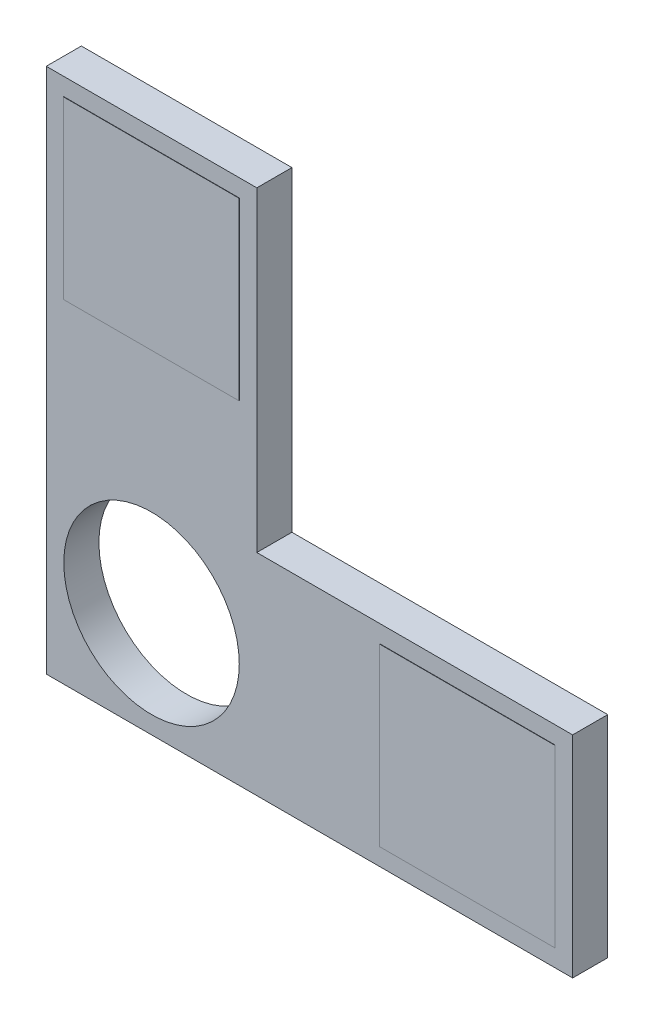
ISO-10303-21;
HEADER;
FILE_DESCRIPTION(('STEP AP214'),'2;1');
FILE_NAME('part.step','',(''),(''),'','','');
FILE_SCHEMA(('AUTOMOTIVE_DESIGN { 1 0 10303 214 1 1 1 1 }'));
ENDSEC;
DATA;
#1=APPLICATION_CONTEXT('core data for automotive mechanical design processes');
#2=APPLICATION_PROTOCOL_DEFINITION('international standard','automotive_design',2000,#1);
#3=PRODUCT_CONTEXT('',#1,'mechanical');
#4=PRODUCT('Part','Part','',(#3));
#5=PRODUCT_RELATED_PRODUCT_CATEGORY('part','',(#4));
#6=PRODUCT_DEFINITION_FORMATION('','',#4);
#7=PRODUCT_DEFINITION_CONTEXT('part definition',#1,'design');
#8=PRODUCT_DEFINITION('design','',#6,#7);
#9=PRODUCT_DEFINITION_SHAPE('','',#8);
#10=(LENGTH_UNIT() NAMED_UNIT(*) SI_UNIT(.MILLI.,.METRE.));
#11=(NAMED_UNIT(*) PLANE_ANGLE_UNIT() SI_UNIT($,.RADIAN.));
#12=(NAMED_UNIT(*) SI_UNIT($,.STERADIAN.) SOLID_ANGLE_UNIT());
#13=UNCERTAINTY_MEASURE_WITH_UNIT(LENGTH_MEASURE(1.E-05),#10,'distance_accuracy_value','');
#14=(GEOMETRIC_REPRESENTATION_CONTEXT(3) GLOBAL_UNCERTAINTY_ASSIGNED_CONTEXT((#13)) GLOBAL_UNIT_ASSIGNED_CONTEXT((#10,
#11,#12)) REPRESENTATION_CONTEXT('',''));
#15=CARTESIAN_POINT('',(0.,0.,0.));
#16=DIRECTION('',(0.,0.,1.));
#17=DIRECTION('',(1.,0.,0.));
#18=AXIS2_PLACEMENT_3D('',#15,#16,#17);
#19=CARTESIAN_POINT('',(0.,0.,10.));
#20=DIRECTION('',(0.,0.,-1.));
#21=DIRECTION('',(-1.,0.,0.));
#22=AXIS2_PLACEMENT_3D('',#19,#20,#21);
#23=PLANE('',#22);
#24=DIRECTION('',(0.,-1.,0.));
#25=VECTOR('',#24,1.);
#26=CARTESIAN_POINT('',(5.,145.,10.));
#27=LINE('',#26,#25);
#28=CARTESIAN_POINT('',(5.,145.,10.));
#29=VERTEX_POINT('',#28);
#30=CARTESIAN_POINT('',(5.00000000000001,95.,10.));
#31=VERTEX_POINT('',#30);
#32=EDGE_CURVE('E155',#29,#31,#27,.T.);
#33=ORIENTED_EDGE('',*,*,#32,.F.);
#34=DIRECTION('',(-1.,0.,0.));
#35=VECTOR('',#34,1.);
#36=CARTESIAN_POINT('',(5.,145.,10.));
#37=LINE('',#36,#35);
#38=CARTESIAN_POINT('',(55.,145.,10.));
#39=VERTEX_POINT('',#38);
#40=EDGE_CURVE('E168',#39,#29,#37,.T.);
#41=ORIENTED_EDGE('',*,*,#40,.F.);
#42=DIRECTION('',(0.,1.,0.));
#43=VECTOR('',#42,1.);
#44=CARTESIAN_POINT('',(55.,145.,10.));
#45=LINE('',#44,#43);
#46=CARTESIAN_POINT('',(55.,95.,10.));
#47=VERTEX_POINT('',#46);
#48=EDGE_CURVE('E177',#47,#39,#45,.T.);
#49=ORIENTED_EDGE('',*,*,#48,.F.);
#50=DIRECTION('',(1.,0.,0.));
#51=VECTOR('',#50,1.);
#52=CARTESIAN_POINT('',(5.00000000000001,95.,10.));
#53=LINE('',#52,#51);
#54=EDGE_CURVE('E158',#31,#47,#53,.T.);
#55=ORIENTED_EDGE('',*,*,#54,.F.);
#56=EDGE_LOOP('',(#33,#41,#49,#55));
#57=FACE_BOUND('',#56,.T.);
#58=DIRECTION('',(-1.,0.,0.));
#59=VECTOR('',#58,1.);
#60=CARTESIAN_POINT('',(0.,150.,10.));
#61=LINE('',#60,#59);
#62=CARTESIAN_POINT('',(60.,150.,10.));
#63=VERTEX_POINT('',#62);
#64=CARTESIAN_POINT('',(0.,150.,10.));
#65=VERTEX_POINT('',#64);
#66=EDGE_CURVE('E200',#63,#65,#61,.T.);
#67=ORIENTED_EDGE('',*,*,#66,.T.);
#68=DIRECTION('',(0.,-1.,0.));
#69=VECTOR('',#68,1.);
#70=CARTESIAN_POINT('',(0.,0.,10.));
#71=LINE('',#70,#69);
#72=CARTESIAN_POINT('',(0.,0.,10.));
#73=VERTEX_POINT('',#72);
#74=EDGE_CURVE('E203',#65,#73,#71,.T.);
#75=ORIENTED_EDGE('',*,*,#74,.T.);
#76=DIRECTION('',(1.,0.,0.));
#77=VECTOR('',#76,1.);
#78=CARTESIAN_POINT('',(150.,0.,10.));
#79=LINE('',#78,#77);
#80=CARTESIAN_POINT('',(150.,0.,10.));
#81=VERTEX_POINT('',#80);
#82=EDGE_CURVE('E206',#73,#81,#79,.T.);
#83=ORIENTED_EDGE('',*,*,#82,.T.);
#84=DIRECTION('',(0.,1.,0.));
#85=VECTOR('',#84,1.);
#86=CARTESIAN_POINT('',(150.,60.,10.));
#87=LINE('',#86,#85);
#88=CARTESIAN_POINT('',(150.,60.,10.));
#89=VERTEX_POINT('',#88);
#90=EDGE_CURVE('E208',#81,#89,#87,.T.);
#91=ORIENTED_EDGE('',*,*,#90,.T.);
#92=DIRECTION('',(-1.,0.,0.));
#93=VECTOR('',#92,1.);
#94=CARTESIAN_POINT('',(60.,60.,10.));
#95=LINE('',#94,#93);
#96=CARTESIAN_POINT('',(60.,60.,10.));
#97=VERTEX_POINT('',#96);
#98=EDGE_CURVE('E210',#89,#97,#95,.T.);
#99=ORIENTED_EDGE('',*,*,#98,.T.);
#100=DIRECTION('',(0.,1.,0.));
#101=VECTOR('',#100,1.);
#102=CARTESIAN_POINT('',(60.,150.,10.));
#103=LINE('',#102,#101);
#104=EDGE_CURVE('E212',#97,#63,#103,.T.);
#105=ORIENTED_EDGE('',*,*,#104,.T.);
#106=EDGE_LOOP('',(#67,#75,#83,#91,#99,#105));
#107=FACE_BOUND('',#106,.T.);
#108=CARTESIAN_POINT('',(30.,30.,10.));
#109=DIRECTION('',(0.,0.,1.));
#110=DIRECTION('',(1.,0.,0.));
#111=AXIS2_PLACEMENT_3D('',#108,#109,#110);
#112=CIRCLE('',#111,25.);
#113=CARTESIAN_POINT('',(55.,30.,10.));
#114=VERTEX_POINT('',#113);
#115=EDGE_CURVE('E194',#114,#114,#112,.T.);
#116=ORIENTED_EDGE('',*,*,#115,.F.);
#117=EDGE_LOOP('',(#116));
#118=FACE_BOUND('',#117,.T.);
#119=DIRECTION('',(0.,1.,0.));
#120=VECTOR('',#119,1.);
#121=CARTESIAN_POINT('',(145.,4.99999999999998,10.));
#122=LINE('',#121,#120);
#123=CARTESIAN_POINT('',(145.,4.99999999999998,10.));
#124=VERTEX_POINT('',#123);
#125=CARTESIAN_POINT('',(145.,54.9999999999999,10.));
#126=VERTEX_POINT('',#125);
#127=EDGE_CURVE('E154',#124,#126,#122,.T.);
#128=ORIENTED_EDGE('',*,*,#127,.F.);
#129=DIRECTION('',(1.,0.,0.));
#130=VECTOR('',#129,1.);
#131=CARTESIAN_POINT('',(145.,4.99999999999998,10.));
#132=LINE('',#131,#130);
#133=CARTESIAN_POINT('',(94.9999999999999,4.99999999999998,10.));
#134=VERTEX_POINT('',#133);
#135=EDGE_CURVE('E151',#134,#124,#132,.T.);
#136=ORIENTED_EDGE('',*,*,#135,.F.);
#137=DIRECTION('',(0.,-1.,0.));
#138=VECTOR('',#137,1.);
#139=CARTESIAN_POINT('',(94.9999999999999,4.99999999999998,10.));
#140=LINE('',#139,#138);
#141=CARTESIAN_POINT('',(94.9999999999999,55.,10.));
#142=VERTEX_POINT('',#141);
#143=EDGE_CURVE('E53',#142,#134,#140,.T.);
#144=ORIENTED_EDGE('',*,*,#143,.F.);
#145=DIRECTION('',(-1.,0.,0.));
#146=VECTOR('',#145,1.);
#147=CARTESIAN_POINT('',(145.,54.9999999999999,10.));
#148=LINE('',#147,#146);
#149=EDGE_CURVE('E48',#126,#142,#148,.T.);
#150=ORIENTED_EDGE('',*,*,#149,.F.);
#151=EDGE_LOOP('',(#128,#136,#144,#150));
#152=FACE_BOUND('',#151,.T.);
#153=ADVANCED_FACE('F33',(#57,#107,#118,#152),#23,.F.);
#154=CARTESIAN_POINT('',(0.,0.,0.));
#155=DIRECTION('',(0.,0.,-1.));
#156=DIRECTION('',(-1.,0.,0.));
#157=AXIS2_PLACEMENT_3D('',#154,#155,#156);
#158=PLANE('',#157);
#159=DIRECTION('',(-1.,0.,0.));
#160=VECTOR('',#159,1.);
#161=CARTESIAN_POINT('',(0.,150.,0.));
#162=LINE('',#161,#160);
#163=CARTESIAN_POINT('',(60.,150.,0.));
#164=VERTEX_POINT('',#163);
#165=CARTESIAN_POINT('',(0.,150.,0.));
#166=VERTEX_POINT('',#165);
#167=EDGE_CURVE('E197',#164,#166,#162,.T.);
#168=ORIENTED_EDGE('',*,*,#167,.F.);
#169=DIRECTION('',(0.,1.,0.));
#170=VECTOR('',#169,1.);
#171=CARTESIAN_POINT('',(60.,150.,0.));
#172=LINE('',#171,#170);
#173=CARTESIAN_POINT('',(60.,60.,0.));
#174=VERTEX_POINT('',#173);
#175=EDGE_CURVE('E204',#174,#164,#172,.T.);
#176=ORIENTED_EDGE('',*,*,#175,.F.);
#177=DIRECTION('',(-1.,0.,0.));
#178=VECTOR('',#177,1.);
#179=CARTESIAN_POINT('',(60.,60.,0.));
#180=LINE('',#179,#178);
#181=CARTESIAN_POINT('',(150.,60.,0.));
#182=VERTEX_POINT('',#181);
#183=EDGE_CURVE('E223',#182,#174,#180,.T.);
#184=ORIENTED_EDGE('',*,*,#183,.F.);
#185=DIRECTION('',(0.,1.,0.));
#186=VECTOR('',#185,1.);
#187=CARTESIAN_POINT('',(150.,60.,0.));
#188=LINE('',#187,#186);
#189=CARTESIAN_POINT('',(150.,0.,0.));
#190=VERTEX_POINT('',#189);
#191=EDGE_CURVE('E221',#190,#182,#188,.T.);
#192=ORIENTED_EDGE('',*,*,#191,.F.);
#193=DIRECTION('',(1.,0.,0.));
#194=VECTOR('',#193,1.);
#195=CARTESIAN_POINT('',(150.,0.,0.));
#196=LINE('',#195,#194);
#197=CARTESIAN_POINT('',(0.,0.,0.));
#198=VERTEX_POINT('',#197);
#199=EDGE_CURVE('E219',#198,#190,#196,.T.);
#200=ORIENTED_EDGE('',*,*,#199,.F.);
#201=DIRECTION('',(0.,-1.,0.));
#202=VECTOR('',#201,1.);
#203=CARTESIAN_POINT('',(0.,0.,0.));
#204=LINE('',#203,#202);
#205=EDGE_CURVE('E217',#166,#198,#204,.T.);
#206=ORIENTED_EDGE('',*,*,#205,.F.);
#207=EDGE_LOOP('',(#168,#176,#184,#192,#200,#206));
#208=FACE_BOUND('',#207,.T.);
#209=CARTESIAN_POINT('',(30.,30.,0.));
#210=DIRECTION('',(0.,0.,1.));
#211=DIRECTION('',(1.,0.,0.));
#212=AXIS2_PLACEMENT_3D('',#209,#210,#211);
#213=CIRCLE('',#212,25.);
#214=CARTESIAN_POINT('',(55.,30.,0.));
#215=VERTEX_POINT('',#214);
#216=EDGE_CURVE('E193',#215,#215,#213,.T.);
#217=ORIENTED_EDGE('',*,*,#216,.T.);
#218=EDGE_LOOP('',(#217));
#219=FACE_BOUND('',#218,.T.);
#220=ADVANCED_FACE('F247',(#208,#219),#158,.T.);
#221=CARTESIAN_POINT('',(0.,150.,10.));
#222=DIRECTION('',(0.,-1.,0.));
#223=DIRECTION('',(0.,0.,-1.));
#224=AXIS2_PLACEMENT_3D('',#221,#222,#223);
#225=PLANE('',#224);
#226=ORIENTED_EDGE('',*,*,#167,.T.);
#227=DIRECTION('',(0.,0.,-1.));
#228=VECTOR('',#227,1.);
#229=CARTESIAN_POINT('',(0.,150.,10.));
#230=LINE('',#229,#228);
#231=EDGE_CURVE('E11',#65,#166,#230,.T.);
#232=ORIENTED_EDGE('',*,*,#231,.F.);
#233=ORIENTED_EDGE('',*,*,#66,.F.);
#234=DIRECTION('',(0.,0.,-1.));
#235=VECTOR('',#234,1.);
#236=CARTESIAN_POINT('',(60.,150.,10.));
#237=LINE('',#236,#235);
#238=EDGE_CURVE('E214',#63,#164,#237,.T.);
#239=ORIENTED_EDGE('',*,*,#238,.T.);
#240=EDGE_LOOP('',(#226,#232,#233,#239));
#241=FACE_BOUND('',#240,.T.);
#242=ADVANCED_FACE('F35',(#241),#225,.F.);
#243=CARTESIAN_POINT('',(0.,0.,10.));
#244=DIRECTION('',(1.,0.,0.));
#245=DIRECTION('',(0.,0.,-1.));
#246=AXIS2_PLACEMENT_3D('',#243,#244,#245);
#247=PLANE('',#246);
#248=ORIENTED_EDGE('',*,*,#205,.T.);
#249=DIRECTION('',(0.,0.,-1.));
#250=VECTOR('',#249,1.);
#251=CARTESIAN_POINT('',(0.,0.,10.));
#252=LINE('',#251,#250);
#253=EDGE_CURVE('E41',#73,#198,#252,.T.);
#254=ORIENTED_EDGE('',*,*,#253,.F.);
#255=ORIENTED_EDGE('',*,*,#74,.F.);
#256=ORIENTED_EDGE('',*,*,#231,.T.);
#257=EDGE_LOOP('',(#248,#254,#255,#256));
#258=FACE_BOUND('',#257,.T.);
#259=ADVANCED_FACE('F265',(#258),#247,.F.);
#260=CARTESIAN_POINT('',(150.,0.,10.));
#261=DIRECTION('',(0.,1.,0.));
#262=DIRECTION('',(-1.,0.,0.));
#263=AXIS2_PLACEMENT_3D('',#260,#261,#262);
#264=PLANE('',#263);
#265=ORIENTED_EDGE('',*,*,#199,.T.);
#266=DIRECTION('',(0.,0.,-1.));
#267=VECTOR('',#266,1.);
#268=CARTESIAN_POINT('',(150.,0.,10.));
#269=LINE('',#268,#267);
#270=EDGE_CURVE('E234',#81,#190,#269,.T.);
#271=ORIENTED_EDGE('',*,*,#270,.F.);
#272=ORIENTED_EDGE('',*,*,#82,.F.);
#273=ORIENTED_EDGE('',*,*,#253,.T.);
#274=EDGE_LOOP('',(#265,#271,#272,#273));
#275=FACE_BOUND('',#274,.T.);
#276=ADVANCED_FACE('F241',(#275),#264,.F.);
#277=CARTESIAN_POINT('',(150.,60.,10.));
#278=DIRECTION('',(-1.,0.,0.));
#279=DIRECTION('',(0.,0.,1.));
#280=AXIS2_PLACEMENT_3D('',#277,#278,#279);
#281=PLANE('',#280);
#282=ORIENTED_EDGE('',*,*,#191,.T.);
#283=DIRECTION('',(0.,0.,-1.));
#284=VECTOR('',#283,1.);
#285=CARTESIAN_POINT('',(150.,60.,10.));
#286=LINE('',#285,#284);
#287=EDGE_CURVE('E231',#89,#182,#286,.T.);
#288=ORIENTED_EDGE('',*,*,#287,.F.);
#289=ORIENTED_EDGE('',*,*,#90,.F.);
#290=ORIENTED_EDGE('',*,*,#270,.T.);
#291=EDGE_LOOP('',(#282,#288,#289,#290));
#292=FACE_BOUND('',#291,.T.);
#293=ADVANCED_FACE('F253',(#292),#281,.F.);
#294=CARTESIAN_POINT('',(60.,60.,10.));
#295=DIRECTION('',(0.,-1.,0.));
#296=DIRECTION('',(0.,0.,-1.));
#297=AXIS2_PLACEMENT_3D('',#294,#295,#296);
#298=PLANE('',#297);
#299=ORIENTED_EDGE('',*,*,#183,.T.);
#300=DIRECTION('',(0.,0.,-1.));
#301=VECTOR('',#300,1.);
#302=CARTESIAN_POINT('',(60.,60.,10.));
#303=LINE('',#302,#301);
#304=EDGE_CURVE('E228',#97,#174,#303,.T.);
#305=ORIENTED_EDGE('',*,*,#304,.F.);
#306=ORIENTED_EDGE('',*,*,#98,.F.);
#307=ORIENTED_EDGE('',*,*,#287,.T.);
#308=EDGE_LOOP('',(#299,#305,#306,#307));
#309=FACE_BOUND('',#308,.T.);
#310=ADVANCED_FACE('F257',(#309),#298,.F.);
#311=CARTESIAN_POINT('',(60.,150.,10.));
#312=DIRECTION('',(-1.,0.,0.));
#313=DIRECTION('',(0.,0.,1.));
#314=AXIS2_PLACEMENT_3D('',#311,#312,#313);
#315=PLANE('',#314);
#316=ORIENTED_EDGE('',*,*,#175,.T.);
#317=ORIENTED_EDGE('',*,*,#238,.F.);
#318=ORIENTED_EDGE('',*,*,#104,.F.);
#319=ORIENTED_EDGE('',*,*,#304,.T.);
#320=EDGE_LOOP('',(#316,#317,#318,#319));
#321=FACE_BOUND('',#320,.T.);
#322=ADVANCED_FACE('F268',(#321),#315,.F.);
#323=CARTESIAN_POINT('',(30.,30.,10.));
#324=DIRECTION('',(0.,0.,-1.));
#325=DIRECTION('',(-1.,0.,0.));
#326=AXIS2_PLACEMENT_3D('',#323,#324,#325);
#327=CYLINDRICAL_SURFACE('',#326,25.);
#328=ORIENTED_EDGE('',*,*,#115,.T.);
#329=EDGE_LOOP('',(#328));
#330=FACE_BOUND('',#329,.T.);
#331=ORIENTED_EDGE('',*,*,#216,.F.);
#332=EDGE_LOOP('',(#331));
#333=FACE_BOUND('',#332,.T.);
#334=ADVANCED_FACE('F270',(#330,#333),#327,.F.);
#335=CARTESIAN_POINT('',(5.,145.,10.1));
#336=DIRECTION('',(1.,0.,0.));
#337=DIRECTION('',(0.,1.,0.));
#338=AXIS2_PLACEMENT_3D('',#335,#336,#337);
#339=PLANE('',#338);
#340=ORIENTED_EDGE('',*,*,#32,.T.);
#341=DIRECTION('',(0.,0.,-1.));
#342=VECTOR('',#341,1.);
#343=CARTESIAN_POINT('',(5.00000000000001,95.,10.1));
#344=LINE('',#343,#342);
#345=CARTESIAN_POINT('',(5.00000000000001,95.,10.1));
#346=VERTEX_POINT('',#345);
#347=EDGE_CURVE('E190',#346,#31,#344,.T.);
#348=ORIENTED_EDGE('',*,*,#347,.F.);
#349=DIRECTION('',(0.,-1.,0.));
#350=VECTOR('',#349,1.);
#351=CARTESIAN_POINT('',(5.,145.,10.1));
#352=LINE('',#351,#350);
#353=CARTESIAN_POINT('',(5.,145.,10.1));
#354=VERTEX_POINT('',#353);
#355=EDGE_CURVE('E164',#354,#346,#352,.T.);
#356=ORIENTED_EDGE('',*,*,#355,.F.);
#357=DIRECTION('',(0.,0.,-1.));
#358=VECTOR('',#357,1.);
#359=CARTESIAN_POINT('',(5.,145.,10.1));
#360=LINE('',#359,#358);
#361=EDGE_CURVE('E173',#354,#29,#360,.T.);
#362=ORIENTED_EDGE('',*,*,#361,.T.);
#363=EDGE_LOOP('',(#340,#348,#356,#362));
#364=FACE_BOUND('',#363,.T.);
#365=ADVANCED_FACE('F276',(#364),#339,.F.);
#366=CARTESIAN_POINT('',(5.00000000000001,95.,10.1));
#367=DIRECTION('',(0.,1.,0.));
#368=DIRECTION('',(0.,0.,1.));
#369=AXIS2_PLACEMENT_3D('',#366,#367,#368);
#370=PLANE('',#369);
#371=ORIENTED_EDGE('',*,*,#54,.T.);
#372=DIRECTION('',(0.,0.,-1.));
#373=VECTOR('',#372,1.);
#374=CARTESIAN_POINT('',(55.,95.,10.1));
#375=LINE('',#374,#373);
#376=CARTESIAN_POINT('',(55.,95.,10.1));
#377=VERTEX_POINT('',#376);
#378=EDGE_CURVE('E187',#377,#47,#375,.T.);
#379=ORIENTED_EDGE('',*,*,#378,.F.);
#380=DIRECTION('',(1.,0.,0.));
#381=VECTOR('',#380,1.);
#382=CARTESIAN_POINT('',(5.00000000000001,95.,10.1));
#383=LINE('',#382,#381);
#384=EDGE_CURVE('E167',#346,#377,#383,.T.);
#385=ORIENTED_EDGE('',*,*,#384,.F.);
#386=ORIENTED_EDGE('',*,*,#347,.T.);
#387=EDGE_LOOP('',(#371,#379,#385,#386));
#388=FACE_BOUND('',#387,.T.);
#389=ADVANCED_FACE('F290',(#388),#370,.F.);
#390=CARTESIAN_POINT('',(55.,145.,10.1));
#391=DIRECTION('',(-1.,0.,0.));
#392=DIRECTION('',(0.,-1.,0.));
#393=AXIS2_PLACEMENT_3D('',#390,#391,#392);
#394=PLANE('',#393);
#395=ORIENTED_EDGE('',*,*,#48,.T.);
#396=DIRECTION('',(0.,0.,-1.));
#397=VECTOR('',#396,1.);
#398=CARTESIAN_POINT('',(55.,145.,10.1));
#399=LINE('',#398,#397);
#400=CARTESIAN_POINT('',(55.,145.,10.1));
#401=VERTEX_POINT('',#400);
#402=EDGE_CURVE('E184',#401,#39,#399,.T.);
#403=ORIENTED_EDGE('',*,*,#402,.F.);
#404=DIRECTION('',(0.,1.,0.));
#405=VECTOR('',#404,1.);
#406=CARTESIAN_POINT('',(55.,145.,10.1));
#407=LINE('',#406,#405);
#408=EDGE_CURVE('E170',#377,#401,#407,.T.);
#409=ORIENTED_EDGE('',*,*,#408,.F.);
#410=ORIENTED_EDGE('',*,*,#378,.T.);
#411=EDGE_LOOP('',(#395,#403,#409,#410));
#412=FACE_BOUND('',#411,.T.);
#413=ADVANCED_FACE('F294',(#412),#394,.F.);
#414=CARTESIAN_POINT('',(5.,145.,10.1));
#415=DIRECTION('',(0.,-1.,0.));
#416=DIRECTION('',(0.,0.,-1.));
#417=AXIS2_PLACEMENT_3D('',#414,#415,#416);
#418=PLANE('',#417);
#419=ORIENTED_EDGE('',*,*,#40,.T.);
#420=ORIENTED_EDGE('',*,*,#361,.F.);
#421=DIRECTION('',(-1.,0.,0.));
#422=VECTOR('',#421,1.);
#423=CARTESIAN_POINT('',(5.,145.,10.1));
#424=LINE('',#423,#422);
#425=EDGE_CURVE('E172',#401,#354,#424,.T.);
#426=ORIENTED_EDGE('',*,*,#425,.F.);
#427=ORIENTED_EDGE('',*,*,#402,.T.);
#428=EDGE_LOOP('',(#419,#420,#426,#427));
#429=FACE_BOUND('',#428,.T.);
#430=ADVANCED_FACE('F298',(#429),#418,.F.);
#431=CARTESIAN_POINT('',(0.,0.,10.1));
#432=DIRECTION('',(0.,0.,1.));
#433=DIRECTION('',(1.,0.,0.));
#434=AXIS2_PLACEMENT_3D('',#431,#432,#433);
#435=PLANE('',#434);
#436=ORIENTED_EDGE('',*,*,#355,.T.);
#437=ORIENTED_EDGE('',*,*,#384,.T.);
#438=ORIENTED_EDGE('',*,*,#408,.T.);
#439=ORIENTED_EDGE('',*,*,#425,.T.);
#440=EDGE_LOOP('',(#436,#437,#438,#439));
#441=FACE_BOUND('',#440,.T.);
#442=ADVANCED_FACE('F302',(#441),#435,.T.);
#443=CARTESIAN_POINT('',(145.,4.99999999999998,10.1));
#444=DIRECTION('',(-1.,0.,0.));
#445=DIRECTION('',(0.,-1.,0.));
#446=AXIS2_PLACEMENT_3D('',#443,#444,#445);
#447=PLANE('',#446);
#448=ORIENTED_EDGE('',*,*,#127,.T.);
#449=DIRECTION('',(0.,0.,-1.));
#450=VECTOR('',#449,1.);
#451=CARTESIAN_POINT('',(145.,54.9999999999999,10.1));
#452=LINE('',#451,#450);
#453=CARTESIAN_POINT('',(145.,54.9999999999999,10.1));
#454=VERTEX_POINT('',#453);
#455=EDGE_CURVE('E135',#454,#126,#452,.T.);
#456=ORIENTED_EDGE('',*,*,#455,.F.);
#457=DIRECTION('',(0.,1.,0.));
#458=VECTOR('',#457,1.);
#459=CARTESIAN_POINT('',(145.,4.99999999999998,10.1));
#460=LINE('',#459,#458);
#461=CARTESIAN_POINT('',(145.,4.99999999999998,10.1));
#462=VERTEX_POINT('',#461);
#463=EDGE_CURVE('E142',#462,#454,#460,.T.);
#464=ORIENTED_EDGE('',*,*,#463,.F.);
#465=DIRECTION('',(0.,0.,-1.));
#466=VECTOR('',#465,1.);
#467=CARTESIAN_POINT('',(145.,4.99999999999998,10.1));
#468=LINE('',#467,#466);
#469=EDGE_CURVE('E438',#462,#124,#468,.T.);
#470=ORIENTED_EDGE('',*,*,#469,.T.);
#471=EDGE_LOOP('',(#448,#456,#464,#470));
#472=FACE_BOUND('',#471,.T.);
#473=ADVANCED_FACE('F153',(#472),#447,.F.);
#474=CARTESIAN_POINT('',(145.,54.9999999999999,10.1));
#475=DIRECTION('',(0.,-1.,0.));
#476=DIRECTION('',(1.,0.,0.));
#477=AXIS2_PLACEMENT_3D('',#474,#475,#476);
#478=PLANE('',#477);
#479=ORIENTED_EDGE('',*,*,#149,.T.);
#480=DIRECTION('',(0.,0.,-1.));
#481=VECTOR('',#480,1.);
#482=CARTESIAN_POINT('',(94.9999999999999,55.,10.1));
#483=LINE('',#482,#481);
#484=CARTESIAN_POINT('',(94.9999999999999,55.,10.1));
#485=VERTEX_POINT('',#484);
#486=EDGE_CURVE('E138',#485,#142,#483,.T.);
#487=ORIENTED_EDGE('',*,*,#486,.F.);
#488=DIRECTION('',(-1.,0.,0.));
#489=VECTOR('',#488,1.);
#490=CARTESIAN_POINT('',(145.,54.9999999999999,10.1));
#491=LINE('',#490,#489);
#492=EDGE_CURVE('E131',#454,#485,#491,.T.);
#493=ORIENTED_EDGE('',*,*,#492,.F.);
#494=ORIENTED_EDGE('',*,*,#455,.T.);
#495=EDGE_LOOP('',(#479,#487,#493,#494));
#496=FACE_BOUND('',#495,.T.);
#497=ADVANCED_FACE('F133',(#496),#478,.F.);
#498=CARTESIAN_POINT('',(94.9999999999999,4.99999999999998,10.1));
#499=DIRECTION('',(1.,0.,0.));
#500=DIRECTION('',(0.,1.,0.));
#501=AXIS2_PLACEMENT_3D('',#498,#499,#500);
#502=PLANE('',#501);
#503=ORIENTED_EDGE('',*,*,#143,.T.);
#504=DIRECTION('',(0.,0.,-1.));
#505=VECTOR('',#504,1.);
#506=CARTESIAN_POINT('',(94.9999999999999,4.99999999999998,10.1));
#507=LINE('',#506,#505);
#508=CARTESIAN_POINT('',(94.9999999999999,4.99999999999998,10.1));
#509=VERTEX_POINT('',#508);
#510=EDGE_CURVE('E160',#509,#134,#507,.T.);
#511=ORIENTED_EDGE('',*,*,#510,.F.);
#512=DIRECTION('',(0.,-1.,0.));
#513=VECTOR('',#512,1.);
#514=CARTESIAN_POINT('',(94.9999999999999,4.99999999999998,10.1));
#515=LINE('',#514,#513);
#516=EDGE_CURVE('E141',#485,#509,#515,.T.);
#517=ORIENTED_EDGE('',*,*,#516,.F.);
#518=ORIENTED_EDGE('',*,*,#486,.T.);
#519=EDGE_LOOP('',(#503,#511,#517,#518));
#520=FACE_BOUND('',#519,.T.);
#521=ADVANCED_FACE('F311',(#520),#502,.F.);
#522=CARTESIAN_POINT('',(145.,4.99999999999998,10.1));
#523=DIRECTION('',(0.,1.,0.));
#524=DIRECTION('',(0.,0.,1.));
#525=AXIS2_PLACEMENT_3D('',#522,#523,#524);
#526=PLANE('',#525);
#527=ORIENTED_EDGE('',*,*,#135,.T.);
#528=ORIENTED_EDGE('',*,*,#469,.F.);
#529=DIRECTION('',(1.,0.,0.));
#530=VECTOR('',#529,1.);
#531=CARTESIAN_POINT('',(145.,4.99999999999998,10.1));
#532=LINE('',#531,#530);
#533=EDGE_CURVE('E147',#509,#462,#532,.T.);
#534=ORIENTED_EDGE('',*,*,#533,.F.);
#535=ORIENTED_EDGE('',*,*,#510,.T.);
#536=EDGE_LOOP('',(#527,#528,#534,#535));
#537=FACE_BOUND('',#536,.T.);
#538=ADVANCED_FACE('F314',(#537),#526,.F.);
#539=CARTESIAN_POINT('',(0.,0.,10.1));
#540=DIRECTION('',(0.,0.,1.));
#541=DIRECTION('',(1.,0.,0.));
#542=AXIS2_PLACEMENT_3D('',#539,#540,#541);
#543=PLANE('',#542);
#544=ORIENTED_EDGE('',*,*,#463,.T.);
#545=ORIENTED_EDGE('',*,*,#492,.T.);
#546=ORIENTED_EDGE('',*,*,#516,.T.);
#547=ORIENTED_EDGE('',*,*,#533,.T.);
#548=EDGE_LOOP('',(#544,#545,#546,#547));
#549=FACE_BOUND('',#548,.T.);
#550=ADVANCED_FACE('F145',(#549),#543,.T.);
#551=CLOSED_SHELL('',(#153,#220,#242,#259,#276,#293,#310,#322,#334,#365,#389,#413,#430,#442,
#473,#497,#521,#538,#550));
#552=MANIFOLD_SOLID_BREP('B2',#551);
#553=ADVANCED_BREP_SHAPE_REPRESENTATION('',(#18,#552),#14);
#554=SHAPE_DEFINITION_REPRESENTATION(#9,#553);
ENDSEC;
END-ISO-10303-21;
